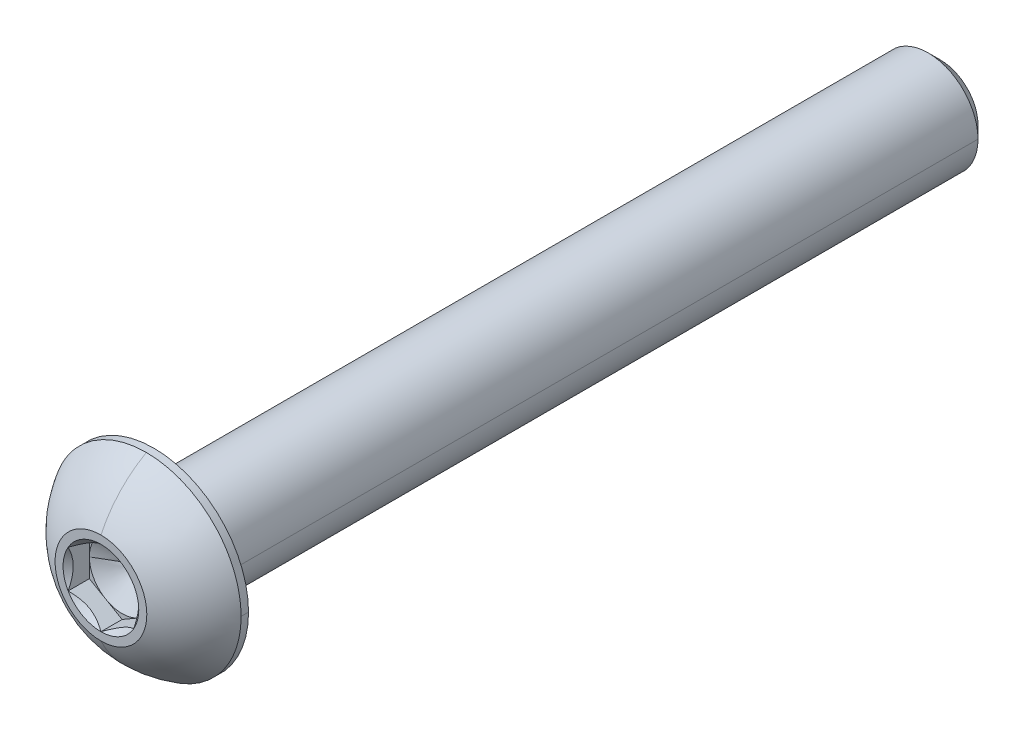
ISO-10303-21;
HEADER;
FILE_DESCRIPTION(('STEP AP214'),'2;1');
FILE_NAME('part.step','',(''),(''),'','','');
FILE_SCHEMA(('AUTOMOTIVE_DESIGN { 1 0 10303 214 1 1 1 1 }'));
ENDSEC;
DATA;
#1=APPLICATION_CONTEXT('core data for automotive mechanical design processes');
#2=APPLICATION_PROTOCOL_DEFINITION('international standard','automotive_design',2000,#1);
#3=PRODUCT_CONTEXT('',#1,'mechanical');
#4=PRODUCT('Part','Part','',(#3));
#5=PRODUCT_RELATED_PRODUCT_CATEGORY('part','',(#4));
#6=PRODUCT_DEFINITION_FORMATION('','',#4);
#7=PRODUCT_DEFINITION_CONTEXT('part definition',#1,'design');
#8=PRODUCT_DEFINITION('design','',#6,#7);
#9=PRODUCT_DEFINITION_SHAPE('','',#8);
#10=(LENGTH_UNIT() NAMED_UNIT(*) SI_UNIT(.MILLI.,.METRE.));
#11=(NAMED_UNIT(*) PLANE_ANGLE_UNIT() SI_UNIT($,.RADIAN.));
#12=(NAMED_UNIT(*) SI_UNIT($,.STERADIAN.) SOLID_ANGLE_UNIT());
#13=UNCERTAINTY_MEASURE_WITH_UNIT(LENGTH_MEASURE(1.E-05),#10,'distance_accuracy_value','');
#14=(GEOMETRIC_REPRESENTATION_CONTEXT(3) GLOBAL_UNCERTAINTY_ASSIGNED_CONTEXT((#13)) GLOBAL_UNIT_ASSIGNED_CONTEXT((#10,
#11,#12)) REPRESENTATION_CONTEXT('',''));
#15=CARTESIAN_POINT('',(0.,0.,0.));
#16=DIRECTION('',(0.,0.,1.));
#17=DIRECTION('',(1.,0.,0.));
#18=AXIS2_PLACEMENT_3D('',#15,#16,#17);
#19=CARTESIAN_POINT('',(0.,0.,20.3327));
#20=DIRECTION('',(0.,0.,1.));
#21=DIRECTION('',(1.,0.,0.));
#22=AXIS2_PLACEMENT_3D('',#19,#20,#21);
#23=CONICAL_SURFACE('',#22,1.83308710467706,0.78539816339745);
#24=CARTESIAN_POINT('',(0.,0.,20.3327));
#25=DIRECTION('',(0.,0.,1.));
#26=DIRECTION('',(1.,0.,0.));
#27=AXIS2_PLACEMENT_3D('',#24,#25,#26);
#28=CIRCLE('',#27,1.83308710467706);
#29=CARTESIAN_POINT('',(1.5875,0.916543552338531,20.3327));
#30=VERTEX_POINT('',#29);
#31=CARTESIAN_POINT('',(0.,1.83308710467706,20.3327));
#32=VERTEX_POINT('',#31);
#33=EDGE_CURVE('E198',#30,#32,#28,.T.);
#34=ORIENTED_EDGE('',*,*,#33,.T.);
#35=CARTESIAN_POINT('',(1.5875,0.916543552338532,20.3327));
#36=CARTESIAN_POINT('',(1.16394825928644,1.16108126385524,20.0881622884833));
#37=CARTESIAN_POINT('',(0.796673872668184,1.37312722983575,20.0871164854632));
#38=CARTESIAN_POINT('',(0.427185428295327,1.58645148265687,20.0860643779788));
#39=CARTESIAN_POINT('',(0.,1.83308710467706,20.3327));
#40=B_SPLINE_CURVE_WITH_KNOTS('',2,(#35,#36,#37,#38,#39),.UNSPECIFIED.,.F.,.F.,(3,2,3),(0.,0.5,
1.),.UNSPECIFIED.);
#41=EDGE_CURVE('E179',#30,#32,#40,.T.);
#42=ORIENTED_EDGE('',*,*,#41,.F.);
#43=EDGE_LOOP('',(#34,#42));
#44=FACE_BOUND('',#43,.T.);
#45=ADVANCED_FACE('F16',(#44),#23,.F.);
#46=CARTESIAN_POINT('',(0.,0.,20.3327));
#47=DIRECTION('',(0.,0.,1.));
#48=DIRECTION('',(1.,0.,0.));
#49=AXIS2_PLACEMENT_3D('',#46,#47,#48);
#50=CONICAL_SURFACE('',#49,1.83308710467706,0.78539816339745);
#51=DIRECTION('',(0.707106781186549,0.,0.707106781186546));
#52=VECTOR('',#51,1.);
#53=CARTESIAN_POINT('',(1.83308710467706,0.,20.3327));
#54=LINE('',#53,#52);
#55=CARTESIAN_POINT('',(1.5875,0.,20.087112895323));
#56=VERTEX_POINT('',#55);
#57=CARTESIAN_POINT('',(1.83308710467706,0.,20.3327));
#58=VERTEX_POINT('',#57);
#59=EDGE_CURVE('E440',#56,#58,#54,.T.);
#60=ORIENTED_EDGE('',*,*,#59,.F.);
#61=CARTESIAN_POINT('',(1.5875,-0.916543552338531,20.3327));
#62=CARTESIAN_POINT('',(1.5875,-0.684378986321009,20.2166177169912));
#63=CARTESIAN_POINT('',(1.5875,-0.471870631820659,20.155758463555));
#64=CARTESIAN_POINT('',(1.5875,-0.232174021607764,20.0871128953229));
#65=CARTESIAN_POINT('',(1.5875,0.,20.0871128953229));
#66=B_SPLINE_CURVE_WITH_KNOTS('',2,(#61,#62,#63,#64,#65),.UNSPECIFIED.,.F.,.F.,(3,2,3),(0.,0.5,
1.),.UNSPECIFIED.);
#67=CARTESIAN_POINT('',(1.5875,-0.916543552338531,20.3327));
#68=VERTEX_POINT('',#67);
#69=EDGE_CURVE('E473',#68,#56,#66,.T.);
#70=ORIENTED_EDGE('',*,*,#69,.F.);
#71=CARTESIAN_POINT('',(0.,0.,20.3327));
#72=DIRECTION('',(0.,0.,1.));
#73=DIRECTION('',(1.,0.,0.));
#74=AXIS2_PLACEMENT_3D('',#71,#72,#73);
#75=CIRCLE('',#74,1.83308710467706);
#76=EDGE_CURVE('E201',#68,#58,#75,.T.);
#77=ORIENTED_EDGE('',*,*,#76,.T.);
#78=EDGE_LOOP('',(#60,#70,#77));
#79=FACE_BOUND('',#78,.T.);
#80=ADVANCED_FACE('F229',(#79),#50,.F.);
#81=CARTESIAN_POINT('',(0.,0.,20.3327));
#82=DIRECTION('',(0.,0.,1.));
#83=DIRECTION('',(1.,0.,0.));
#84=AXIS2_PLACEMENT_3D('',#81,#82,#83);
#85=CONICAL_SURFACE('',#84,1.83308710467706,0.78539816339745);
#86=CARTESIAN_POINT('',(0.,0.,20.3327));
#87=DIRECTION('',(0.,0.,1.));
#88=DIRECTION('',(1.,0.,0.));
#89=AXIS2_PLACEMENT_3D('',#86,#87,#88);
#90=CIRCLE('',#89,1.83308710467706);
#91=CARTESIAN_POINT('',(0.,-1.83308710467706,20.3327));
#92=VERTEX_POINT('',#91);
#93=EDGE_CURVE('E344',#92,#68,#90,.T.);
#94=ORIENTED_EDGE('',*,*,#93,.T.);
#95=CARTESIAN_POINT('',(0.,-1.83308710467706,20.3327));
#96=CARTESIAN_POINT('',(0.423551740713597,-1.58854939316033,20.0881622884833));
#97=CARTESIAN_POINT('',(0.790826127331816,-1.37650342717985,20.0871164854632));
#98=CARTESIAN_POINT('',(1.16031457170468,-1.16317917435872,20.0860643779788));
#99=CARTESIAN_POINT('',(1.5875,-0.91654355233853,20.3327));
#100=B_SPLINE_CURVE_WITH_KNOTS('',2,(#95,#96,#97,#98,#99),.UNSPECIFIED.,.F.,.F.,(3,2,3),(0.,0.5,
1.),.UNSPECIFIED.);
#101=EDGE_CURVE('E487',#92,#68,#100,.T.);
#102=ORIENTED_EDGE('',*,*,#101,.F.);
#103=EDGE_LOOP('',(#94,#102));
#104=FACE_BOUND('',#103,.T.);
#105=ADVANCED_FACE('F316',(#104),#85,.F.);
#106=CARTESIAN_POINT('',(0.,0.,20.3327));
#107=DIRECTION('',(0.,0.,1.));
#108=DIRECTION('',(1.,0.,0.));
#109=AXIS2_PLACEMENT_3D('',#106,#107,#108);
#110=CONICAL_SURFACE('',#109,1.83308710467706,0.78539816339745);
#111=CARTESIAN_POINT('',(0.,0.,20.3327));
#112=DIRECTION('',(0.,0.,1.));
#113=DIRECTION('',(1.,0.,0.));
#114=AXIS2_PLACEMENT_3D('',#111,#112,#113);
#115=CIRCLE('',#114,1.83308710467706);
#116=CARTESIAN_POINT('',(-1.5875,-0.916543552338532,20.3327));
#117=VERTEX_POINT('',#116);
#118=EDGE_CURVE('E340',#117,#92,#115,.T.);
#119=ORIENTED_EDGE('',*,*,#118,.T.);
#120=CARTESIAN_POINT('',(-1.5875,-0.916543552338532,20.3327));
#121=CARTESIAN_POINT('',(-1.16394825928893,-1.1610812638538,20.0881622884847));
#122=CARTESIAN_POINT('',(-0.796673872668184,-1.37312722983575,20.0871164854632));
#123=CARTESIAN_POINT('',(-0.427185428297807,-1.58645148265544,20.0860643779774));
#124=CARTESIAN_POINT('',(0.,-1.83308710467706,20.3327));
#125=B_SPLINE_CURVE_WITH_KNOTS('',2,(#120,#121,#122,#123,#124),.UNSPECIFIED.,.F.,.F.,(3,2,3),
(0.,0.5,1.),.UNSPECIFIED.);
#126=EDGE_CURVE('E141',#117,#92,#125,.T.);
#127=ORIENTED_EDGE('',*,*,#126,.F.);
#128=EDGE_LOOP('',(#119,#127));
#129=FACE_BOUND('',#128,.T.);
#130=ADVANCED_FACE('F227',(#129),#110,.F.);
#131=CARTESIAN_POINT('',(0.,0.,20.3327));
#132=DIRECTION('',(0.,0.,1.));
#133=DIRECTION('',(1.,0.,0.));
#134=AXIS2_PLACEMENT_3D('',#131,#132,#133);
#135=CONICAL_SURFACE('',#134,1.83308710467706,0.78539816339745);
#136=CARTESIAN_POINT('',(0.,0.,20.3327));
#137=DIRECTION('',(0.,0.,1.));
#138=DIRECTION('',(1.,0.,0.));
#139=AXIS2_PLACEMENT_3D('',#136,#137,#138);
#140=CIRCLE('',#139,1.83308710467706);
#141=CARTESIAN_POINT('',(-1.5875,0.916543552338531,20.3327));
#142=VERTEX_POINT('',#141);
#143=EDGE_CURVE('E343',#142,#117,#140,.T.);
#144=ORIENTED_EDGE('',*,*,#143,.T.);
#145=CARTESIAN_POINT('',(-1.5875,0.916543552338531,20.3327));
#146=CARTESIAN_POINT('',(-1.5875,0.683298746668409,20.2160775971649));
#147=CARTESIAN_POINT('',(-1.5875,0.472019012921087,20.1558007465519));
#148=CARTESIAN_POINT('',(-1.5875,0.231534553258339,20.0871919614463));
#149=CARTESIAN_POINT('',(-1.5875,-1.26642650600303E-05,20.0871128953735));
#150=CARTESIAN_POINT('',(-1.5875,-0.230421051574654,20.0870342181752));
#151=CARTESIAN_POINT('',(-1.5875,-0.471876640894336,20.1557601756763));
#152=CARTESIAN_POINT('',(-1.5875,-0.68264892548077,20.2157526865711));
#153=CARTESIAN_POINT('',(-1.5875,-0.91654355233853,20.3327));
#154=B_SPLINE_CURVE_WITH_KNOTS('',2,(#145,#146,#147,#148,#149,#150,#151,#152,#153),
.UNSPECIFIED.,.F.,.F.,(3,2,2,2,3),(0.,0.25,0.5,0.75,1.),.UNSPECIFIED.);
#155=EDGE_CURVE('E165',#142,#117,#154,.T.);
#156=ORIENTED_EDGE('',*,*,#155,.F.);
#157=EDGE_LOOP('',(#144,#156));
#158=FACE_BOUND('',#157,.T.);
#159=ADVANCED_FACE('F222',(#158),#135,.F.);
#160=CARTESIAN_POINT('',(0.,0.,20.3327));
#161=DIRECTION('',(0.,0.,1.));
#162=DIRECTION('',(1.,0.,0.));
#163=AXIS2_PLACEMENT_3D('',#160,#161,#162);
#164=CONICAL_SURFACE('',#163,1.83308710467706,0.78539816339745);
#165=CARTESIAN_POINT('',(0.,0.,20.3327));
#166=DIRECTION('',(0.,0.,1.));
#167=DIRECTION('',(1.,0.,0.));
#168=AXIS2_PLACEMENT_3D('',#165,#166,#167);
#169=CIRCLE('',#168,1.83308710467706);
#170=EDGE_CURVE('E202',#32,#142,#169,.T.);
#171=ORIENTED_EDGE('',*,*,#170,.T.);
#172=CARTESIAN_POINT('',(0.,1.83308710467706,20.3327));
#173=CARTESIAN_POINT('',(-0.423551740711061,1.58854939316179,20.0881622884847));
#174=CARTESIAN_POINT('',(-0.790826127331815,1.37650342717985,20.0871164854632));
#175=CARTESIAN_POINT('',(-1.1603145717022,1.16317917436015,20.0860643779774));
#176=CARTESIAN_POINT('',(-1.5875,0.91654355233853,20.3327));
#177=B_SPLINE_CURVE_WITH_KNOTS('',2,(#172,#173,#174,#175,#176),.UNSPECIFIED.,.F.,.F.,(3,2,3),
(0.,0.5,1.),.UNSPECIFIED.);
#178=EDGE_CURVE('E247',#32,#142,#177,.T.);
#179=ORIENTED_EDGE('',*,*,#178,.F.);
#180=EDGE_LOOP('',(#171,#179));
#181=FACE_BOUND('',#180,.T.);
#182=ADVANCED_FACE('F226',(#181),#164,.F.);
#183=CARTESIAN_POINT('',(0.,0.,19.30654));
#184=DIRECTION('',(0.,0.,1.));
#185=DIRECTION('',(1.,0.,0.));
#186=AXIS2_PLACEMENT_3D('',#183,#184,#185);
#187=CONICAL_SURFACE('',#186,1.5875,1.0471975511966);
#188=DIRECTION('',(-0.86602540378444,0.,0.5));
#189=VECTOR('',#188,1.);
#190=CARTESIAN_POINT('',(-1.5875,0.,19.30654));
#191=LINE('',#190,#189);
#192=CARTESIAN_POINT('',(0.,0.,18.3899964476615));
#193=VERTEX_POINT('',#192);
#194=CARTESIAN_POINT('',(-1.5875,0.,19.30654));
#195=VERTEX_POINT('',#194);
#196=EDGE_CURVE('E923',#193,#195,#191,.T.);
#197=ORIENTED_EDGE('',*,*,#196,.F.);
#198=DIRECTION('',(0.86602540378444,0.,0.5));
#199=VECTOR('',#198,1.);
#200=CARTESIAN_POINT('',(1.5875,0.,19.30654));
#201=LINE('',#200,#199);
#202=CARTESIAN_POINT('',(1.5875,0.,19.30654));
#203=VERTEX_POINT('',#202);
#204=EDGE_CURVE('E439',#193,#203,#201,.T.);
#205=ORIENTED_EDGE('',*,*,#204,.T.);
#206=CARTESIAN_POINT('',(0.,0.,19.30654));
#207=DIRECTION('',(0.,0.,1.));
#208=DIRECTION('',(1.,0.,0.));
#209=AXIS2_PLACEMENT_3D('',#206,#207,#208);
#210=CIRCLE('',#209,1.5875);
#211=CARTESIAN_POINT('',(0.79375,1.3748153285078,19.30654));
#212=VERTEX_POINT('',#211);
#213=EDGE_CURVE('E11',#203,#212,#210,.T.);
#214=ORIENTED_EDGE('',*,*,#213,.T.);
#215=CARTESIAN_POINT('',(0.,0.,19.30654));
#216=DIRECTION('',(0.,0.,1.));
#217=DIRECTION('',(1.,0.,0.));
#218=AXIS2_PLACEMENT_3D('',#215,#216,#217);
#219=CIRCLE('',#218,1.5875);
#220=CARTESIAN_POINT('',(-0.79375,1.3748153285078,19.30654));
#221=VERTEX_POINT('',#220);
#222=EDGE_CURVE('E29',#212,#221,#219,.T.);
#223=ORIENTED_EDGE('',*,*,#222,.T.);
#224=CARTESIAN_POINT('',(0.,0.,19.30654));
#225=DIRECTION('',(0.,0.,1.));
#226=DIRECTION('',(1.,0.,0.));
#227=AXIS2_PLACEMENT_3D('',#224,#225,#226);
#228=CIRCLE('',#227,1.5875);
#229=EDGE_CURVE('E825',#221,#195,#228,.T.);
#230=ORIENTED_EDGE('',*,*,#229,.T.);
#231=EDGE_LOOP('',(#197,#205,#214,#223,#230));
#232=FACE_BOUND('',#231,.T.);
#233=ADVANCED_FACE('F300',(#232),#187,.F.);
#234=CARTESIAN_POINT('',(0.,0.,19.30654));
#235=DIRECTION('',(0.,0.,1.));
#236=DIRECTION('',(1.,0.,0.));
#237=AXIS2_PLACEMENT_3D('',#234,#235,#236);
#238=PLANE('',#237);
#239=ORIENTED_EDGE('',*,*,#213,.F.);
#240=DIRECTION('',(0.,1.,0.));
#241=VECTOR('',#240,1.);
#242=CARTESIAN_POINT('',(1.5875,-0.916543552338531,19.30654));
#243=LINE('',#242,#241);
#244=CARTESIAN_POINT('',(1.5875,0.916543552338532,19.30654));
#245=VERTEX_POINT('',#244);
#246=EDGE_CURVE('E908',#203,#245,#243,.T.);
#247=ORIENTED_EDGE('',*,*,#246,.T.);
#248=DIRECTION('',(-0.866025403784439,0.5,0.));
#249=VECTOR('',#248,1.);
#250=CARTESIAN_POINT('',(1.5875,0.916543552338532,19.30654));
#251=LINE('',#250,#249);
#252=EDGE_CURVE('E175',#245,#212,#251,.T.);
#253=ORIENTED_EDGE('',*,*,#252,.T.);
#254=EDGE_LOOP('',(#239,#247,#253));
#255=FACE_BOUND('',#254,.T.);
#256=ADVANCED_FACE('F288',(#255),#238,.T.);
#257=CARTESIAN_POINT('',(0.,0.,19.30654));
#258=DIRECTION('',(0.,0.,1.));
#259=DIRECTION('',(1.,0.,0.));
#260=AXIS2_PLACEMENT_3D('',#257,#258,#259);
#261=PLANE('',#260);
#262=ORIENTED_EDGE('',*,*,#222,.F.);
#263=DIRECTION('',(-0.866025403784439,0.5,0.));
#264=VECTOR('',#263,1.);
#265=CARTESIAN_POINT('',(1.5875,0.916543552338532,19.30654));
#266=LINE('',#265,#264);
#267=CARTESIAN_POINT('',(0.,1.83308710467706,19.30654));
#268=VERTEX_POINT('',#267);
#269=EDGE_CURVE('E168',#212,#268,#266,.T.);
#270=ORIENTED_EDGE('',*,*,#269,.T.);
#271=DIRECTION('',(-0.866025403784438,-0.5,0.));
#272=VECTOR('',#271,1.);
#273=CARTESIAN_POINT('',(0.,1.83308710467706,19.30654));
#274=LINE('',#273,#272);
#275=EDGE_CURVE('E152',#268,#221,#274,.T.);
#276=ORIENTED_EDGE('',*,*,#275,.T.);
#277=EDGE_LOOP('',(#262,#270,#276));
#278=FACE_BOUND('',#277,.T.);
#279=ADVANCED_FACE('F169',(#278),#261,.T.);
#280=CARTESIAN_POINT('',(0.,0.,19.30654));
#281=DIRECTION('',(0.,0.,1.));
#282=DIRECTION('',(1.,0.,0.));
#283=AXIS2_PLACEMENT_3D('',#280,#281,#282);
#284=PLANE('',#283);
#285=ORIENTED_EDGE('',*,*,#229,.F.);
#286=DIRECTION('',(-0.866025403784438,-0.5,0.));
#287=VECTOR('',#286,1.);
#288=CARTESIAN_POINT('',(0.,1.83308710467706,19.30654));
#289=LINE('',#288,#287);
#290=CARTESIAN_POINT('',(-1.5875,0.91654355233853,19.30654));
#291=VERTEX_POINT('',#290);
#292=EDGE_CURVE('E161',#221,#291,#289,.T.);
#293=ORIENTED_EDGE('',*,*,#292,.T.);
#294=DIRECTION('',(0.,-1.,0.));
#295=VECTOR('',#294,1.);
#296=CARTESIAN_POINT('',(-1.5875,0.91654355233853,19.30654));
#297=LINE('',#296,#295);
#298=EDGE_CURVE('E822',#291,#195,#297,.T.);
#299=ORIENTED_EDGE('',*,*,#298,.T.);
#300=EDGE_LOOP('',(#285,#293,#299));
#301=FACE_BOUND('',#300,.T.);
#302=ADVANCED_FACE('F287',(#301),#284,.T.);
#303=CARTESIAN_POINT('',(0.,0.,19.30654));
#304=DIRECTION('',(0.,0.,1.));
#305=DIRECTION('',(1.,0.,0.));
#306=AXIS2_PLACEMENT_3D('',#303,#304,#305);
#307=PLANE('',#306);
#308=CARTESIAN_POINT('',(0.,0.,19.30654));
#309=DIRECTION('',(0.,0.,1.));
#310=DIRECTION('',(1.,0.,0.));
#311=AXIS2_PLACEMENT_3D('',#308,#309,#310);
#312=CIRCLE('',#311,1.5875);
#313=CARTESIAN_POINT('',(-0.79375,-1.3748153285078,19.30654));
#314=VERTEX_POINT('',#313);
#315=EDGE_CURVE('E880',#195,#314,#312,.T.);
#316=ORIENTED_EDGE('',*,*,#315,.F.);
#317=DIRECTION('',(0.,-1.,0.));
#318=VECTOR('',#317,1.);
#319=CARTESIAN_POINT('',(-1.5875,0.91654355233853,19.30654));
#320=LINE('',#319,#318);
#321=CARTESIAN_POINT('',(-1.5875,-0.916543552338532,19.30654));
#322=VERTEX_POINT('',#321);
#323=EDGE_CURVE('E382',#195,#322,#320,.T.);
#324=ORIENTED_EDGE('',*,*,#323,.T.);
#325=DIRECTION('',(0.866025403784439,-0.5,0.));
#326=VECTOR('',#325,1.);
#327=CARTESIAN_POINT('',(-1.5875,-0.916543552338532,19.30654));
#328=LINE('',#327,#326);
#329=EDGE_CURVE('E1057',#322,#314,#328,.T.);
#330=ORIENTED_EDGE('',*,*,#329,.T.);
#331=EDGE_LOOP('',(#316,#324,#330));
#332=FACE_BOUND('',#331,.T.);
#333=ADVANCED_FACE('F18',(#332),#307,.T.);
#334=CARTESIAN_POINT('',(0.,0.,19.30654));
#335=DIRECTION('',(0.,0.,1.));
#336=DIRECTION('',(1.,0.,0.));
#337=AXIS2_PLACEMENT_3D('',#334,#335,#336);
#338=PLANE('',#337);
#339=CARTESIAN_POINT('',(0.,0.,19.30654));
#340=DIRECTION('',(0.,0.,1.));
#341=DIRECTION('',(1.,0.,0.));
#342=AXIS2_PLACEMENT_3D('',#339,#340,#341);
#343=CIRCLE('',#342,1.5875);
#344=CARTESIAN_POINT('',(0.79375,-1.3748153285078,19.30654));
#345=VERTEX_POINT('',#344);
#346=EDGE_CURVE('E875',#314,#345,#343,.T.);
#347=ORIENTED_EDGE('',*,*,#346,.F.);
#348=DIRECTION('',(0.866025403784439,-0.5,0.));
#349=VECTOR('',#348,1.);
#350=CARTESIAN_POINT('',(-1.5875,-0.916543552338532,19.30654));
#351=LINE('',#350,#349);
#352=CARTESIAN_POINT('',(0.,-1.83308710467706,19.30654));
#353=VERTEX_POINT('',#352);
#354=EDGE_CURVE('E337',#314,#353,#351,.T.);
#355=ORIENTED_EDGE('',*,*,#354,.T.);
#356=DIRECTION('',(0.866025403784438,0.5,0.));
#357=VECTOR('',#356,1.);
#358=CARTESIAN_POINT('',(0.,-1.83308710467706,19.30654));
#359=LINE('',#358,#357);
#360=EDGE_CURVE('E865',#353,#345,#359,.T.);
#361=ORIENTED_EDGE('',*,*,#360,.T.);
#362=EDGE_LOOP('',(#347,#355,#361));
#363=FACE_BOUND('',#362,.T.);
#364=ADVANCED_FACE('F404',(#363),#338,.T.);
#365=CARTESIAN_POINT('',(0.,0.,19.30654));
#366=DIRECTION('',(0.,0.,1.));
#367=DIRECTION('',(1.,0.,0.));
#368=AXIS2_PLACEMENT_3D('',#365,#366,#367);
#369=PLANE('',#368);
#370=CARTESIAN_POINT('',(0.,0.,19.30654));
#371=DIRECTION('',(0.,0.,1.));
#372=DIRECTION('',(1.,0.,0.));
#373=AXIS2_PLACEMENT_3D('',#370,#371,#372);
#374=CIRCLE('',#373,1.5875);
#375=EDGE_CURVE('E879',#345,#203,#374,.T.);
#376=ORIENTED_EDGE('',*,*,#375,.F.);
#377=DIRECTION('',(0.866025403784438,0.5,0.));
#378=VECTOR('',#377,1.);
#379=CARTESIAN_POINT('',(0.,-1.83308710467706,19.30654));
#380=LINE('',#379,#378);
#381=CARTESIAN_POINT('',(1.5875,-0.916543552338531,19.30654));
#382=VERTEX_POINT('',#381);
#383=EDGE_CURVE('E486',#345,#382,#380,.T.);
#384=ORIENTED_EDGE('',*,*,#383,.T.);
#385=DIRECTION('',(0.,1.,0.));
#386=VECTOR('',#385,1.);
#387=CARTESIAN_POINT('',(1.5875,-0.916543552338531,19.30654));
#388=LINE('',#387,#386);
#389=EDGE_CURVE('E44',#382,#203,#388,.T.);
#390=ORIENTED_EDGE('',*,*,#389,.T.);
#391=EDGE_LOOP('',(#376,#384,#390));
#392=FACE_BOUND('',#391,.T.);
#393=ADVANCED_FACE('F272',(#392),#369,.T.);
#394=CARTESIAN_POINT('',(1.5875,-0.916543552338531,20.3327));
#395=DIRECTION('',(-1.,0.,0.));
#396=DIRECTION('',(0.,1.,0.));
#397=AXIS2_PLACEMENT_3D('',#394,#395,#396);
#398=PLANE('',#397);
#399=ORIENTED_EDGE('',*,*,#69,.T.);
#400=CARTESIAN_POINT('',(1.5875,0.,20.0871128953229));
#401=CARTESIAN_POINT('',(1.5875,0.229762965263571,20.0871128953229));
#402=CARTESIAN_POINT('',(1.5875,0.472025034449919,20.1558024627176));
#403=CARTESIAN_POINT('',(1.5875,0.681581043057824,20.2152187453596));
#404=CARTESIAN_POINT('',(1.5875,0.916543552338529,20.3327));
#405=B_SPLINE_CURVE_WITH_KNOTS('',2,(#400,#401,#402,#403,#404),.UNSPECIFIED.,.F.,.F.,(3,2,3),
(0.,0.5,1.),.UNSPECIFIED.);
#406=EDGE_CURVE('E447',#56,#30,#405,.T.);
#407=ORIENTED_EDGE('',*,*,#406,.T.);
#408=DIRECTION('',(0.,0.,-1.));
#409=VECTOR('',#408,1.);
#410=CARTESIAN_POINT('',(1.5875,0.916543552338532,20.3327));
#411=LINE('',#410,#409);
#412=EDGE_CURVE('E425',#30,#245,#411,.T.);
#413=ORIENTED_EDGE('',*,*,#412,.T.);
#414=ORIENTED_EDGE('',*,*,#246,.F.);
#415=ORIENTED_EDGE('',*,*,#389,.F.);
#416=DIRECTION('',(0.,0.,-1.));
#417=VECTOR('',#416,1.);
#418=CARTESIAN_POINT('',(1.5875,-0.916543552338531,20.3327));
#419=LINE('',#418,#417);
#420=EDGE_CURVE('E477',#68,#382,#419,.T.);
#421=ORIENTED_EDGE('',*,*,#420,.F.);
#422=EDGE_LOOP('',(#399,#407,#413,#414,#415,#421));
#423=FACE_BOUND('',#422,.T.);
#424=ADVANCED_FACE('F450',(#423),#398,.T.);
#425=CARTESIAN_POINT('',(0.,-1.83308710467706,20.3327));
#426=DIRECTION('',(-0.5,0.866025403784438,0.));
#427=DIRECTION('',(0.,0.,1.));
#428=AXIS2_PLACEMENT_3D('',#425,#426,#427);
#429=PLANE('',#428);
#430=ORIENTED_EDGE('',*,*,#101,.T.);
#431=ORIENTED_EDGE('',*,*,#420,.T.);
#432=ORIENTED_EDGE('',*,*,#383,.F.);
#433=ORIENTED_EDGE('',*,*,#360,.F.);
#434=DIRECTION('',(0.,0.,-1.));
#435=VECTOR('',#434,1.);
#436=CARTESIAN_POINT('',(0.,-1.83308710467706,20.3327));
#437=LINE('',#436,#435);
#438=EDGE_CURVE('E328',#92,#353,#437,.T.);
#439=ORIENTED_EDGE('',*,*,#438,.F.);
#440=EDGE_LOOP('',(#430,#431,#432,#433,#439));
#441=FACE_BOUND('',#440,.T.);
#442=ADVANCED_FACE('F363',(#441),#429,.T.);
#443=CARTESIAN_POINT('',(-1.5875,-0.916543552338532,20.3327));
#444=DIRECTION('',(0.5,0.866025403784439,0.));
#445=DIRECTION('',(0.,0.,-1.));
#446=AXIS2_PLACEMENT_3D('',#443,#444,#445);
#447=PLANE('',#446);
#448=ORIENTED_EDGE('',*,*,#126,.T.);
#449=ORIENTED_EDGE('',*,*,#438,.T.);
#450=ORIENTED_EDGE('',*,*,#354,.F.);
#451=ORIENTED_EDGE('',*,*,#329,.F.);
#452=DIRECTION('',(0.,0.,-1.));
#453=VECTOR('',#452,1.);
#454=CARTESIAN_POINT('',(-1.5875,-0.916543552338532,20.3327));
#455=LINE('',#454,#453);
#456=EDGE_CURVE('E373',#117,#322,#455,.T.);
#457=ORIENTED_EDGE('',*,*,#456,.F.);
#458=EDGE_LOOP('',(#448,#449,#450,#451,#457));
#459=FACE_BOUND('',#458,.T.);
#460=ADVANCED_FACE('F353',(#459),#447,.T.);
#461=CARTESIAN_POINT('',(-1.5875,0.91654355233853,20.3327));
#462=DIRECTION('',(1.,0.,0.));
#463=DIRECTION('',(0.,1.,0.));
#464=AXIS2_PLACEMENT_3D('',#461,#462,#463);
#465=PLANE('',#464);
#466=ORIENTED_EDGE('',*,*,#155,.T.);
#467=ORIENTED_EDGE('',*,*,#456,.T.);
#468=ORIENTED_EDGE('',*,*,#323,.F.);
#469=ORIENTED_EDGE('',*,*,#298,.F.);
#470=DIRECTION('',(0.,0.,-1.));
#471=VECTOR('',#470,1.);
#472=CARTESIAN_POINT('',(-1.5875,0.91654355233853,20.3327));
#473=LINE('',#472,#471);
#474=EDGE_CURVE('E239',#142,#291,#473,.T.);
#475=ORIENTED_EDGE('',*,*,#474,.F.);
#476=EDGE_LOOP('',(#466,#467,#468,#469,#475));
#477=FACE_BOUND('',#476,.T.);
#478=ADVANCED_FACE('F271',(#477),#465,.T.);
#479=CARTESIAN_POINT('',(0.,1.83308710467706,20.3327));
#480=DIRECTION('',(0.5,-0.866025403784438,0.));
#481=DIRECTION('',(0.,0.,-1.));
#482=AXIS2_PLACEMENT_3D('',#479,#480,#481);
#483=PLANE('',#482);
#484=ORIENTED_EDGE('',*,*,#178,.T.);
#485=ORIENTED_EDGE('',*,*,#474,.T.);
#486=ORIENTED_EDGE('',*,*,#292,.F.);
#487=ORIENTED_EDGE('',*,*,#275,.F.);
#488=DIRECTION('',(0.,0.,-1.));
#489=VECTOR('',#488,1.);
#490=CARTESIAN_POINT('',(0.,1.83308710467706,20.3327));
#491=LINE('',#490,#489);
#492=EDGE_CURVE('E157',#32,#268,#491,.T.);
#493=ORIENTED_EDGE('',*,*,#492,.F.);
#494=EDGE_LOOP('',(#484,#485,#486,#487,#493));
#495=FACE_BOUND('',#494,.T.);
#496=ADVANCED_FACE('F155',(#495),#483,.T.);
#497=CARTESIAN_POINT('',(1.5875,0.916543552338532,20.3327));
#498=DIRECTION('',(-0.5,-0.866025403784439,0.));
#499=DIRECTION('',(-0.866025403784439,0.5,0.));
#500=AXIS2_PLACEMENT_3D('',#497,#498,#499);
#501=PLANE('',#500);
#502=ORIENTED_EDGE('',*,*,#41,.T.);
#503=ORIENTED_EDGE('',*,*,#492,.T.);
#504=ORIENTED_EDGE('',*,*,#269,.F.);
#505=ORIENTED_EDGE('',*,*,#252,.F.);
#506=ORIENTED_EDGE('',*,*,#412,.F.);
#507=EDGE_LOOP('',(#502,#503,#504,#505,#506));
#508=FACE_BOUND('',#507,.T.);
#509=ADVANCED_FACE('F177',(#508),#501,.T.);
#510=CARTESIAN_POINT('',(0.,1.8176748,-20.3327));
#511=DIRECTION('',(0.,0.,1.));
#512=DIRECTION('',(1.,0.,0.));
#513=AXIS2_PLACEMENT_3D('',#510,#511,#512);
#514=PLANE('',#513);
#515=CARTESIAN_POINT('',(0.,0.,-20.3327));
#516=DIRECTION('',(0.,0.,1.));
#517=DIRECTION('',(1.,0.,0.));
#518=AXIS2_PLACEMENT_3D('',#515,#516,#517);
#519=CIRCLE('',#518,1.8176748);
#520=CARTESIAN_POINT('',(1.8176748,0.,-20.3327));
#521=VERTEX_POINT('',#520);
#522=CARTESIAN_POINT('',(-1.8176748,0.,-20.3327));
#523=VERTEX_POINT('',#522);
#524=EDGE_CURVE('E965',#521,#523,#519,.T.);
#525=ORIENTED_EDGE('',*,*,#524,.F.);
#526=CARTESIAN_POINT('',(0.,0.,-20.3327));
#527=DIRECTION('',(0.,0.,1.));
#528=DIRECTION('',(1.,0.,0.));
#529=AXIS2_PLACEMENT_3D('',#526,#527,#528);
#530=CIRCLE('',#529,1.8176748);
#531=EDGE_CURVE('E388',#523,#521,#530,.T.);
#532=ORIENTED_EDGE('',*,*,#531,.F.);
#533=EDGE_LOOP('',(#525,#532));
#534=FACE_BOUND('',#533,.T.);
#535=ADVANCED_FACE('F219',(#534),#514,.F.);
#536=CARTESIAN_POINT('',(0.,0.,15.5811096257943));
#537=DIRECTION('',(-1.,0.,0.));
#538=DIRECTION('',(0.,1.,0.));
#539=AXIS2_PLACEMENT_3D('',#536,#537,#538);
#540=SPHERICAL_SURFACE('',#539,5.24567606074224);
#541=CARTESIAN_POINT('',(0.,0.,15.5811096257943));
#542=DIRECTION('',(-1.,0.,0.));
#543=DIRECTION('',(0.,-1.,0.));
#544=AXIS2_PLACEMENT_3D('',#541,#542,#543);
#545=CIRCLE('',#544,5.24567606074224);
#546=CARTESIAN_POINT('',(0.,-4.5847,18.1301571428571));
#547=VERTEX_POINT('',#546);
#548=CARTESIAN_POINT('',(0.,-2.2225,20.3327));
#549=VERTEX_POINT('',#548);
#550=EDGE_CURVE('E931',#547,#549,#545,.T.);
#551=ORIENTED_EDGE('',*,*,#550,.F.);
#552=CARTESIAN_POINT('',(0.,0.,18.1301571428571));
#553=DIRECTION('',(0.,0.,1.));
#554=DIRECTION('',(1.,0.,0.));
#555=AXIS2_PLACEMENT_3D('',#552,#553,#554);
#556=CIRCLE('',#555,4.5847);
#557=CARTESIAN_POINT('',(4.5847,0.,18.1301571428571));
#558=VERTEX_POINT('',#557);
#559=EDGE_CURVE('E189',#547,#558,#556,.T.);
#560=ORIENTED_EDGE('',*,*,#559,.T.);
#561=CARTESIAN_POINT('',(0.,0.,18.1301571428571));
#562=DIRECTION('',(0.,0.,1.));
#563=DIRECTION('',(1.,0.,0.));
#564=AXIS2_PLACEMENT_3D('',#561,#562,#563);
#565=CIRCLE('',#564,4.5847);
#566=CARTESIAN_POINT('',(0.,4.5847,18.1301571428571));
#567=VERTEX_POINT('',#566);
#568=EDGE_CURVE('E900',#558,#567,#565,.T.);
#569=ORIENTED_EDGE('',*,*,#568,.T.);
#570=CARTESIAN_POINT('',(0.,0.,15.5811096257943));
#571=DIRECTION('',(1.,0.,0.));
#572=DIRECTION('',(0.,0.,-1.));
#573=AXIS2_PLACEMENT_3D('',#570,#571,#572);
#574=CIRCLE('',#573,5.24567606074224);
#575=CARTESIAN_POINT('',(0.,2.2225,20.3327));
#576=VERTEX_POINT('',#575);
#577=EDGE_CURVE('E843',#567,#576,#574,.T.);
#578=ORIENTED_EDGE('',*,*,#577,.T.);
#579=CARTESIAN_POINT('',(0.,0.,20.3327));
#580=DIRECTION('',(0.,0.,1.));
#581=DIRECTION('',(1.,0.,0.));
#582=AXIS2_PLACEMENT_3D('',#579,#580,#581);
#583=CIRCLE('',#582,2.2225);
#584=EDGE_CURVE('E253',#549,#576,#583,.T.);
#585=ORIENTED_EDGE('',*,*,#584,.F.);
#586=EDGE_LOOP('',(#551,#560,#569,#578,#585));
#587=FACE_BOUND('',#586,.T.);
#588=ADVANCED_FACE('F278',(#587),#540,.T.);
#589=CARTESIAN_POINT('',(0.,0.,20.3327));
#590=DIRECTION('',(0.,0.,1.));
#591=DIRECTION('',(1.,0.,0.));
#592=AXIS2_PLACEMENT_3D('',#589,#590,#591);
#593=CYLINDRICAL_SURFACE('',#592,4.5847);
#594=DIRECTION('',(0.,0.,1.));
#595=VECTOR('',#594,1.);
#596=CARTESIAN_POINT('',(-4.5847,0.,20.3327));
#597=LINE('',#596,#595);
#598=CARTESIAN_POINT('',(-4.5847,0.,17.7673));
#599=VERTEX_POINT('',#598);
#600=CARTESIAN_POINT('',(-4.5847,0.,18.1301571428571));
#601=VERTEX_POINT('',#600);
#602=EDGE_CURVE('E904',#599,#601,#597,.T.);
#603=ORIENTED_EDGE('',*,*,#602,.F.);
#604=CARTESIAN_POINT('',(0.,0.,17.7673));
#605=DIRECTION('',(0.,0.,1.));
#606=DIRECTION('',(1.,0.,0.));
#607=AXIS2_PLACEMENT_3D('',#604,#605,#606);
#608=CIRCLE('',#607,4.5847);
#609=CARTESIAN_POINT('',(4.5847,0.,17.7673));
#610=VERTEX_POINT('',#609);
#611=EDGE_CURVE('E850',#599,#610,#608,.T.);
#612=ORIENTED_EDGE('',*,*,#611,.T.);
#613=DIRECTION('',(0.,0.,1.));
#614=VECTOR('',#613,1.);
#615=CARTESIAN_POINT('',(4.5847,0.,20.3327));
#616=LINE('',#615,#614);
#617=EDGE_CURVE('E903',#610,#558,#616,.T.);
#618=ORIENTED_EDGE('',*,*,#617,.T.);
#619=ORIENTED_EDGE('',*,*,#559,.F.);
#620=CARTESIAN_POINT('',(0.,0.,18.1301571428571));
#621=DIRECTION('',(0.,0.,1.));
#622=DIRECTION('',(1.,0.,0.));
#623=AXIS2_PLACEMENT_3D('',#620,#621,#622);
#624=CIRCLE('',#623,4.5847);
#625=EDGE_CURVE('E934',#601,#547,#624,.T.);
#626=ORIENTED_EDGE('',*,*,#625,.F.);
#627=EDGE_LOOP('',(#603,#612,#618,#619,#626));
#628=FACE_BOUND('',#627,.T.);
#629=ADVANCED_FACE('F274',(#628),#593,.T.);
#630=CARTESIAN_POINT('',(0.,4.5847,17.7673));
#631=DIRECTION('',(0.,0.,1.));
#632=DIRECTION('',(1.,0.,0.));
#633=AXIS2_PLACEMENT_3D('',#630,#631,#632);
#634=PLANE('',#633);
#635=CARTESIAN_POINT('',(0.,0.,17.7673));
#636=DIRECTION('',(0.,0.,1.));
#637=DIRECTION('',(1.,0.,0.));
#638=AXIS2_PLACEMENT_3D('',#635,#636,#637);
#639=CIRCLE('',#638,2.413);
#640=CARTESIAN_POINT('',(2.413,0.,17.7673));
#641=VERTEX_POINT('',#640);
#642=CARTESIAN_POINT('',(-2.413,0.,17.7673));
#643=VERTEX_POINT('',#642);
#644=EDGE_CURVE('E978',#641,#643,#639,.T.);
#645=ORIENTED_EDGE('',*,*,#644,.T.);
#646=CARTESIAN_POINT('',(0.,0.,17.7673));
#647=DIRECTION('',(0.,0.,1.));
#648=DIRECTION('',(1.,0.,0.));
#649=AXIS2_PLACEMENT_3D('',#646,#647,#648);
#650=CIRCLE('',#649,2.413);
#651=EDGE_CURVE('E847',#643,#641,#650,.T.);
#652=ORIENTED_EDGE('',*,*,#651,.T.);
#653=EDGE_LOOP('',(#645,#652));
#654=FACE_BOUND('',#653,.T.);
#655=CARTESIAN_POINT('',(0.,0.,17.7673));
#656=DIRECTION('',(0.,0.,1.));
#657=DIRECTION('',(1.,0.,0.));
#658=AXIS2_PLACEMENT_3D('',#655,#656,#657);
#659=CIRCLE('',#658,4.5847);
#660=EDGE_CURVE('E842',#610,#599,#659,.T.);
#661=ORIENTED_EDGE('',*,*,#660,.F.);
#662=ORIENTED_EDGE('',*,*,#611,.F.);
#663=EDGE_LOOP('',(#661,#662));
#664=FACE_BOUND('',#663,.T.);
#665=ADVANCED_FACE('F277',(#654,#664),#634,.F.);
#666=CARTESIAN_POINT('',(0.,0.,20.3327));
#667=DIRECTION('',(0.,0.,1.));
#668=DIRECTION('',(1.,0.,0.));
#669=AXIS2_PLACEMENT_3D('',#666,#667,#668);
#670=CYLINDRICAL_SURFACE('',#669,2.413);
#671=DIRECTION('',(0.,0.,1.));
#672=VECTOR('',#671,1.);
#673=CARTESIAN_POINT('',(-2.413,0.,20.3327));
#674=LINE('',#673,#672);
#675=CARTESIAN_POINT('',(-2.413,0.,-19.7373748));
#676=VERTEX_POINT('',#675);
#677=EDGE_CURVE('E974',#676,#643,#674,.T.);
#678=ORIENTED_EDGE('',*,*,#677,.F.);
#679=CARTESIAN_POINT('',(0.,0.,-19.7373748));
#680=DIRECTION('',(0.,0.,1.));
#681=DIRECTION('',(1.,0.,0.));
#682=AXIS2_PLACEMENT_3D('',#679,#680,#681);
#683=CIRCLE('',#682,2.413);
#684=CARTESIAN_POINT('',(2.413,0.,-19.7373748));
#685=VERTEX_POINT('',#684);
#686=EDGE_CURVE('E834',#676,#685,#683,.T.);
#687=ORIENTED_EDGE('',*,*,#686,.T.);
#688=DIRECTION('',(0.,0.,1.));
#689=VECTOR('',#688,1.);
#690=CARTESIAN_POINT('',(2.413,0.,20.3327));
#691=LINE('',#690,#689);
#692=EDGE_CURVE('E970',#685,#641,#691,.T.);
#693=ORIENTED_EDGE('',*,*,#692,.T.);
#694=ORIENTED_EDGE('',*,*,#651,.F.);
#695=EDGE_LOOP('',(#678,#687,#693,#694));
#696=FACE_BOUND('',#695,.T.);
#697=ADVANCED_FACE('F295',(#696),#670,.T.);
#698=CARTESIAN_POINT('',(0.,0.,-20.3327));
#699=DIRECTION('',(0.,0.,1.));
#700=DIRECTION('',(1.,0.,0.));
#701=AXIS2_PLACEMENT_3D('',#698,#699,#700);
#702=CONICAL_SURFACE('',#701,1.8176748,0.785398163397449);
#703=DIRECTION('',(-0.707106781186548,0.,0.707106781186547));
#704=VECTOR('',#703,1.);
#705=CARTESIAN_POINT('',(-1.8176748,0.,-20.3327));
#706=LINE('',#705,#704);
#707=EDGE_CURVE('E969',#523,#676,#706,.T.);
#708=ORIENTED_EDGE('',*,*,#707,.F.);
#709=ORIENTED_EDGE('',*,*,#531,.T.);
#710=DIRECTION('',(0.707106781186548,0.,0.707106781186547));
#711=VECTOR('',#710,1.);
#712=CARTESIAN_POINT('',(1.8176748,0.,-20.3327));
#713=LINE('',#712,#711);
#714=EDGE_CURVE('E983',#521,#685,#713,.T.);
#715=ORIENTED_EDGE('',*,*,#714,.T.);
#716=ORIENTED_EDGE('',*,*,#686,.F.);
#717=EDGE_LOOP('',(#708,#709,#715,#716));
#718=FACE_BOUND('',#717,.T.);
#719=ADVANCED_FACE('F304',(#718),#702,.T.);
#720=CARTESIAN_POINT('',(0.,1.5875,20.3327));
#721=DIRECTION('',(0.,0.,-1.));
#722=DIRECTION('',(0.,-1.,0.));
#723=AXIS2_PLACEMENT_3D('',#720,#721,#722);
#724=PLANE('',#723);
#725=ORIENTED_EDGE('',*,*,#170,.F.);
#726=ORIENTED_EDGE('',*,*,#33,.F.);
#727=CARTESIAN_POINT('',(0.,0.,20.3327));
#728=DIRECTION('',(0.,0.,1.));
#729=DIRECTION('',(1.,0.,0.));
#730=AXIS2_PLACEMENT_3D('',#727,#728,#729);
#731=CIRCLE('',#730,1.83308710467706);
#732=EDGE_CURVE('E436',#58,#30,#731,.T.);
#733=ORIENTED_EDGE('',*,*,#732,.F.);
#734=ORIENTED_EDGE('',*,*,#76,.F.);
#735=ORIENTED_EDGE('',*,*,#93,.F.);
#736=ORIENTED_EDGE('',*,*,#118,.F.);
#737=ORIENTED_EDGE('',*,*,#143,.F.);
#738=EDGE_LOOP('',(#725,#726,#733,#734,#735,#736,#737));
#739=FACE_BOUND('',#738,.T.);
#740=CARTESIAN_POINT('',(0.,0.,20.3327));
#741=DIRECTION('',(0.,0.,1.));
#742=DIRECTION('',(1.,0.,0.));
#743=AXIS2_PLACEMENT_3D('',#740,#741,#742);
#744=CIRCLE('',#743,2.2225);
#745=EDGE_CURVE('E896',#576,#549,#744,.T.);
#746=ORIENTED_EDGE('',*,*,#745,.T.);
#747=ORIENTED_EDGE('',*,*,#584,.T.);
#748=EDGE_LOOP('',(#746,#747));
#749=FACE_BOUND('',#748,.T.);
#750=ADVANCED_FACE('F364',(#739,#749),#724,.F.);
#751=CARTESIAN_POINT('',(0.,0.,-20.3327));
#752=DIRECTION('',(0.,0.,1.));
#753=DIRECTION('',(1.,0.,0.));
#754=AXIS2_PLACEMENT_3D('',#751,#752,#753);
#755=CONICAL_SURFACE('',#754,1.8176748,0.785398163397449);
#756=ORIENTED_EDGE('',*,*,#524,.T.);
#757=ORIENTED_EDGE('',*,*,#707,.T.);
#758=CARTESIAN_POINT('',(0.,0.,-19.7373748));
#759=DIRECTION('',(0.,0.,1.));
#760=DIRECTION('',(1.,0.,0.));
#761=AXIS2_PLACEMENT_3D('',#758,#759,#760);
#762=CIRCLE('',#761,2.413);
#763=EDGE_CURVE('E917',#685,#676,#762,.T.);
#764=ORIENTED_EDGE('',*,*,#763,.F.);
#765=ORIENTED_EDGE('',*,*,#714,.F.);
#766=EDGE_LOOP('',(#756,#757,#764,#765));
#767=FACE_BOUND('',#766,.T.);
#768=ADVANCED_FACE('F220',(#767),#755,.T.);
#769=CARTESIAN_POINT('',(0.,0.,20.3327));
#770=DIRECTION('',(0.,0.,1.));
#771=DIRECTION('',(1.,0.,0.));
#772=AXIS2_PLACEMENT_3D('',#769,#770,#771);
#773=CYLINDRICAL_SURFACE('',#772,2.413);
#774=ORIENTED_EDGE('',*,*,#763,.T.);
#775=ORIENTED_EDGE('',*,*,#677,.T.);
#776=ORIENTED_EDGE('',*,*,#644,.F.);
#777=ORIENTED_EDGE('',*,*,#692,.F.);
#778=EDGE_LOOP('',(#774,#775,#776,#777));
#779=FACE_BOUND('',#778,.T.);
#780=ADVANCED_FACE('F314',(#779),#773,.T.);
#781=CARTESIAN_POINT('',(0.,0.,20.3327));
#782=DIRECTION('',(0.,0.,1.));
#783=DIRECTION('',(1.,0.,0.));
#784=AXIS2_PLACEMENT_3D('',#781,#782,#783);
#785=CYLINDRICAL_SURFACE('',#784,4.5847);
#786=ORIENTED_EDGE('',*,*,#660,.T.);
#787=ORIENTED_EDGE('',*,*,#602,.T.);
#788=CARTESIAN_POINT('',(0.,0.,18.1301571428571));
#789=DIRECTION('',(0.,0.,1.));
#790=DIRECTION('',(1.,0.,0.));
#791=AXIS2_PLACEMENT_3D('',#788,#789,#790);
#792=CIRCLE('',#791,4.5847);
#793=EDGE_CURVE('E838',#567,#601,#792,.T.);
#794=ORIENTED_EDGE('',*,*,#793,.F.);
#795=ORIENTED_EDGE('',*,*,#568,.F.);
#796=ORIENTED_EDGE('',*,*,#617,.F.);
#797=EDGE_LOOP('',(#786,#787,#794,#795,#796));
#798=FACE_BOUND('',#797,.T.);
#799=ADVANCED_FACE('F284',(#798),#785,.T.);
#800=CARTESIAN_POINT('',(0.,0.,15.5811096257943));
#801=DIRECTION('',(-1.,0.,0.));
#802=DIRECTION('',(0.,1.,0.));
#803=AXIS2_PLACEMENT_3D('',#800,#801,#802);
#804=SPHERICAL_SURFACE('',#803,5.24567606074224);
#805=ORIENTED_EDGE('',*,*,#625,.T.);
#806=ORIENTED_EDGE('',*,*,#550,.T.);
#807=ORIENTED_EDGE('',*,*,#745,.F.);
#808=ORIENTED_EDGE('',*,*,#577,.F.);
#809=ORIENTED_EDGE('',*,*,#793,.T.);
#810=EDGE_LOOP('',(#805,#806,#807,#808,#809));
#811=FACE_BOUND('',#810,.T.);
#812=ADVANCED_FACE('F280',(#811),#804,.T.);
#813=CARTESIAN_POINT('',(0.,0.,19.30654));
#814=DIRECTION('',(0.,0.,1.));
#815=DIRECTION('',(1.,0.,0.));
#816=AXIS2_PLACEMENT_3D('',#813,#814,#815);
#817=CONICAL_SURFACE('',#816,1.5875,1.0471975511966);
#818=ORIENTED_EDGE('',*,*,#204,.F.);
#819=ORIENTED_EDGE('',*,*,#196,.T.);
#820=ORIENTED_EDGE('',*,*,#315,.T.);
#821=ORIENTED_EDGE('',*,*,#346,.T.);
#822=ORIENTED_EDGE('',*,*,#375,.T.);
#823=EDGE_LOOP('',(#818,#819,#820,#821,#822));
#824=FACE_BOUND('',#823,.T.);
#825=ADVANCED_FACE('F283',(#824),#817,.F.);
#826=CARTESIAN_POINT('',(0.,0.,20.3327));
#827=DIRECTION('',(0.,0.,1.));
#828=DIRECTION('',(1.,0.,0.));
#829=AXIS2_PLACEMENT_3D('',#826,#827,#828);
#830=CONICAL_SURFACE('',#829,1.83308710467706,0.78539816339745);
#831=ORIENTED_EDGE('',*,*,#406,.F.);
#832=ORIENTED_EDGE('',*,*,#59,.T.);
#833=ORIENTED_EDGE('',*,*,#732,.T.);
#834=EDGE_LOOP('',(#831,#832,#833));
#835=FACE_BOUND('',#834,.T.);
#836=ADVANCED_FACE('F289',(#835),#830,.F.);
#837=CLOSED_SHELL('',(#45,#80,#105,#130,#159,#182,#233,#256,#279,#302,#333,#364,#393,#424,#442,
#460,#478,#496,#509,#535,#588,#629,#665,#697,#719,#750,#768,#780,#799,#812,#825,#836));
#838=MANIFOLD_SOLID_BREP('B1',#837);
#839=ADVANCED_BREP_SHAPE_REPRESENTATION('',(#18,#838),#14);
#840=SHAPE_DEFINITION_REPRESENTATION(#9,#839);
ENDSEC;
END-ISO-10303-21;
